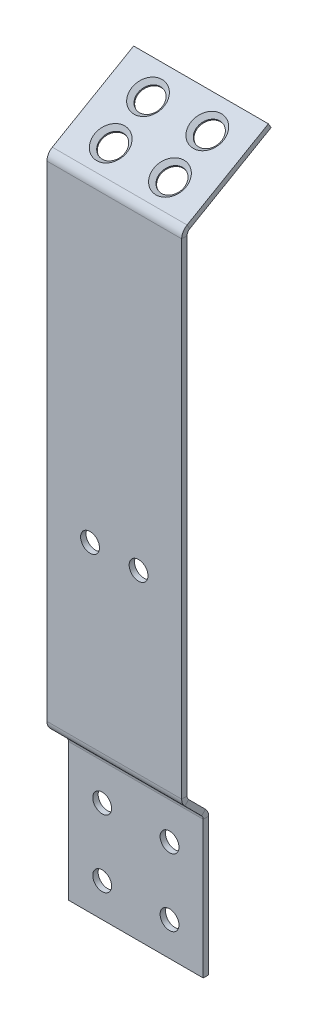
ISO-10303-21;
HEADER;
FILE_DESCRIPTION(('STEP AP214'),'2;1');
FILE_NAME('part.step','',(''),(''),'','','');
FILE_SCHEMA(('AUTOMOTIVE_DESIGN { 1 0 10303 214 1 1 1 1 }'));
ENDSEC;
DATA;
#1=APPLICATION_CONTEXT('core data for automotive mechanical design processes');
#2=APPLICATION_PROTOCOL_DEFINITION('international standard','automotive_design',2000,#1);
#3=PRODUCT_CONTEXT('',#1,'mechanical');
#4=PRODUCT('Part','Part','',(#3));
#5=PRODUCT_RELATED_PRODUCT_CATEGORY('part','',(#4));
#6=PRODUCT_DEFINITION_FORMATION('','',#4);
#7=PRODUCT_DEFINITION_CONTEXT('part definition',#1,'design');
#8=PRODUCT_DEFINITION('design','',#6,#7);
#9=PRODUCT_DEFINITION_SHAPE('','',#8);
#10=(LENGTH_UNIT() NAMED_UNIT(*) SI_UNIT(.MILLI.,.METRE.));
#11=(NAMED_UNIT(*) PLANE_ANGLE_UNIT() SI_UNIT($,.RADIAN.));
#12=(NAMED_UNIT(*) SI_UNIT($,.STERADIAN.) SOLID_ANGLE_UNIT());
#13=UNCERTAINTY_MEASURE_WITH_UNIT(LENGTH_MEASURE(1.E-05),#10,'distance_accuracy_value','');
#14=(GEOMETRIC_REPRESENTATION_CONTEXT(3) GLOBAL_UNCERTAINTY_ASSIGNED_CONTEXT((#13)) GLOBAL_UNIT_ASSIGNED_CONTEXT((#10,
#11,#12)) REPRESENTATION_CONTEXT('',''));
#15=CARTESIAN_POINT('',(0.,0.,0.));
#16=DIRECTION('',(0.,0.,1.));
#17=DIRECTION('',(1.,0.,0.));
#18=AXIS2_PLACEMENT_3D('',#15,#16,#17);
#19=CARTESIAN_POINT('',(-25.,242.195792681395,9.99999999999999));
#20=DIRECTION('',(0.,0.,-1.));
#21=DIRECTION('',(-1.,0.,0.));
#22=AXIS2_PLACEMENT_3D('',#19,#20,#21);
#23=PLANE('',#22);
#24=CARTESIAN_POINT('',(9.,127.,9.99999999999999));
#25=DIRECTION('',(0.,0.,1.));
#26=DIRECTION('',(1.,0.,0.));
#27=AXIS2_PLACEMENT_3D('',#24,#25,#26);
#28=CIRCLE('',#27,3.50000000000001);
#29=CARTESIAN_POINT('',(12.5,127.,9.99999999999999));
#30=VERTEX_POINT('',#29);
#31=EDGE_CURVE('E798',#30,#30,#28,.T.);
#32=ORIENTED_EDGE('',*,*,#31,.F.);
#33=EDGE_LOOP('',(#32));
#34=FACE_BOUND('',#33,.T.);
#35=CARTESIAN_POINT('',(-9.,127.,9.99999999999999));
#36=DIRECTION('',(0.,0.,1.));
#37=DIRECTION('',(1.,0.,0.));
#38=AXIS2_PLACEMENT_3D('',#35,#36,#37);
#39=CIRCLE('',#38,3.50000000000001);
#40=CARTESIAN_POINT('',(-5.49999999999999,127.,9.99999999999999));
#41=VERTEX_POINT('',#40);
#42=EDGE_CURVE('E791',#41,#41,#39,.T.);
#43=ORIENTED_EDGE('',*,*,#42,.F.);
#44=EDGE_LOOP('',(#43));
#45=FACE_BOUND('',#44,.T.);
#46=DIRECTION('',(0.,-1.,0.));
#47=VECTOR('',#46,1.);
#48=CARTESIAN_POINT('',(-25.,-2.80420731860514,10.));
#49=LINE('',#48,#47);
#50=CARTESIAN_POINT('',(-25.,241.535898384862,10.));
#51=VERTEX_POINT('',#50);
#52=CARTESIAN_POINT('',(-25.,61.4852813742385,10.0000000334032));
#53=VERTEX_POINT('',#52);
#54=EDGE_CURVE('E189',#51,#53,#49,.T.);
#55=ORIENTED_EDGE('',*,*,#54,.T.);
#56=DIRECTION('',(1.,0.,0.));
#57=VECTOR('',#56,1.);
#58=CARTESIAN_POINT('',(-25.,61.4852813742385,10.));
#59=LINE('',#58,#57);
#60=CARTESIAN_POINT('',(25.,61.4852813742385,10.));
#61=VERTEX_POINT('',#60);
#62=EDGE_CURVE('E177',#53,#61,#59,.T.);
#63=ORIENTED_EDGE('',*,*,#62,.T.);
#64=DIRECTION('',(0.,1.,0.));
#65=VECTOR('',#64,1.);
#66=CARTESIAN_POINT('',(25.,-2.80420731860514,10.));
#67=LINE('',#66,#65);
#68=CARTESIAN_POINT('',(25.,241.535898384862,10.));
#69=VERTEX_POINT('',#68);
#70=EDGE_CURVE('E181',#61,#69,#67,.T.);
#71=ORIENTED_EDGE('',*,*,#70,.T.);
#72=DIRECTION('',(1.,0.,0.));
#73=VECTOR('',#72,1.);
#74=CARTESIAN_POINT('',(25.,241.535898384862,10.));
#75=LINE('',#74,#73);
#76=EDGE_CURVE('E145',#69,#51,#75,.F.);
#77=ORIENTED_EDGE('',*,*,#76,.T.);
#78=EDGE_LOOP('',(#55,#63,#71,#77));
#79=FACE_BOUND('',#78,.T.);
#80=ADVANCED_FACE('F65',(#34,#45,#79),#23,.F.);
#81=CARTESIAN_POINT('',(25.,-2.80420731860514,10.));
#82=DIRECTION('',(-1.,0.,0.));
#83=DIRECTION('',(0.,0.,1.));
#84=AXIS2_PLACEMENT_3D('',#81,#82,#83);
#85=PLANE('',#84);
#86=ORIENTED_EDGE('',*,*,#70,.F.);
#87=DIRECTION('',(0.,0.,-1.));
#88=VECTOR('',#87,1.);
#89=CARTESIAN_POINT('',(25.,61.4852813742386,10.0000000000005));
#90=LINE('',#89,#88);
#91=CARTESIAN_POINT('',(25.,61.4852813742385,8.00000003340319));
#92=VERTEX_POINT('',#91);
#93=EDGE_CURVE('E13',#61,#92,#90,.T.);
#94=ORIENTED_EDGE('',*,*,#93,.T.);
#95=DIRECTION('',(0.,1.,0.));
#96=VECTOR('',#95,1.);
#97=CARTESIAN_POINT('',(25.,-2.80420731860514,8.00000000000001));
#98=LINE('',#97,#96);
#99=CARTESIAN_POINT('',(25.,241.535898384862,8.00000000000003));
#100=VERTEX_POINT('',#99);
#101=EDGE_CURVE('E186',#92,#100,#98,.T.);
#102=ORIENTED_EDGE('',*,*,#101,.T.);
#103=DIRECTION('',(0.,0.,1.));
#104=VECTOR('',#103,1.);
#105=CARTESIAN_POINT('',(25.,241.535898384862,8.00000000000003));
#106=LINE('',#105,#104);
#107=EDGE_CURVE('E240',#100,#69,#106,.T.);
#108=ORIENTED_EDGE('',*,*,#107,.T.);
#109=EDGE_LOOP('',(#86,#94,#102,#108));
#110=FACE_BOUND('',#109,.T.);
#111=ADVANCED_FACE('F67',(#110),#85,.F.);
#112=CARTESIAN_POINT('',(-25.,-2.80420731860514,10.));
#113=DIRECTION('',(1.,0.,0.));
#114=DIRECTION('',(0.,0.,-1.));
#115=AXIS2_PLACEMENT_3D('',#112,#113,#114);
#116=PLANE('',#115);
#117=DIRECTION('',(0.,-1.,0.));
#118=VECTOR('',#117,1.);
#119=CARTESIAN_POINT('',(-25.,-2.80420731860515,8.00000000000001));
#120=LINE('',#119,#118);
#121=CARTESIAN_POINT('',(-25.,241.535898384862,8.00000000000003));
#122=VERTEX_POINT('',#121);
#123=CARTESIAN_POINT('',(-24.9999999999999,61.4852813742385,8.00000003340319));
#124=VERTEX_POINT('',#123);
#125=EDGE_CURVE('E176',#122,#124,#120,.T.);
#126=ORIENTED_EDGE('',*,*,#125,.T.);
#127=DIRECTION('',(0.,0.,1.));
#128=VECTOR('',#127,1.);
#129=CARTESIAN_POINT('',(-25.,61.4852813742386,10.0000000000005));
#130=LINE('',#129,#128);
#131=EDGE_CURVE('E180',#124,#53,#130,.T.);
#132=ORIENTED_EDGE('',*,*,#131,.T.);
#133=ORIENTED_EDGE('',*,*,#54,.F.);
#134=DIRECTION('',(0.,0.,1.));
#135=VECTOR('',#134,1.);
#136=CARTESIAN_POINT('',(-25.,241.535898384862,8.00000000000003));
#137=LINE('',#136,#135);
#138=EDGE_CURVE('E322',#122,#51,#137,.T.);
#139=ORIENTED_EDGE('',*,*,#138,.F.);
#140=EDGE_LOOP('',(#126,#132,#133,#139));
#141=FACE_BOUND('',#140,.T.);
#142=ADVANCED_FACE('F366',(#141),#116,.F.);
#143=CARTESIAN_POINT('',(-25.,242.195792681395,7.99999999999999));
#144=DIRECTION('',(0.,0.,-1.));
#145=DIRECTION('',(-1.,0.,0.));
#146=AXIS2_PLACEMENT_3D('',#143,#144,#145);
#147=PLANE('',#146);
#148=CARTESIAN_POINT('',(9.,127.,7.99999999999999));
#149=DIRECTION('',(0.,0.,1.));
#150=DIRECTION('',(1.,0.,0.));
#151=AXIS2_PLACEMENT_3D('',#148,#149,#150);
#152=CIRCLE('',#151,3.50000000000001);
#153=CARTESIAN_POINT('',(12.5,127.,7.99999999999999));
#154=VERTEX_POINT('',#153);
#155=EDGE_CURVE('E383',#154,#154,#152,.T.);
#156=ORIENTED_EDGE('',*,*,#155,.T.);
#157=EDGE_LOOP('',(#156));
#158=FACE_BOUND('',#157,.T.);
#159=CARTESIAN_POINT('',(-9.,127.,7.99999999999999));
#160=DIRECTION('',(0.,0.,1.));
#161=DIRECTION('',(1.,0.,0.));
#162=AXIS2_PLACEMENT_3D('',#159,#160,#161);
#163=CIRCLE('',#162,3.50000000000001);
#164=CARTESIAN_POINT('',(-5.49999999999999,127.,7.99999999999999));
#165=VERTEX_POINT('',#164);
#166=EDGE_CURVE('E387',#165,#165,#163,.T.);
#167=ORIENTED_EDGE('',*,*,#166,.T.);
#168=EDGE_LOOP('',(#167));
#169=FACE_BOUND('',#168,.T.);
#170=DIRECTION('',(1.,0.,0.));
#171=VECTOR('',#170,1.);
#172=CARTESIAN_POINT('',(-25.,61.4852813742386,8.00000000000001));
#173=LINE('',#172,#171);
#174=EDGE_CURVE('E74',#124,#92,#173,.T.);
#175=ORIENTED_EDGE('',*,*,#174,.F.);
#176=ORIENTED_EDGE('',*,*,#125,.F.);
#177=DIRECTION('',(1.,0.,0.));
#178=VECTOR('',#177,1.);
#179=CARTESIAN_POINT('',(25.,241.535898384862,8.00000000000003));
#180=LINE('',#179,#178);
#181=EDGE_CURVE('E158',#100,#122,#180,.F.);
#182=ORIENTED_EDGE('',*,*,#181,.F.);
#183=ORIENTED_EDGE('',*,*,#101,.F.);
#184=EDGE_LOOP('',(#175,#176,#182,#183));
#185=FACE_BOUND('',#184,.T.);
#186=ADVANCED_FACE('F372',(#158,#169,#185),#147,.T.);
#187=CARTESIAN_POINT('',(-25.,241.535898384862,6.00000000000003));
#188=DIRECTION('',(-1.,0.,0.));
#189=DIRECTION('',(0.,0.,1.));
#190=AXIS2_PLACEMENT_3D('',#187,#188,#189);
#191=PLANE('',#190);
#192=DIRECTION('',(0.,-0.866025403784437,-0.500000000000004));
#193=VECTOR('',#192,1.);
#194=CARTESIAN_POINT('',(-25.,245.,8.00000000000004));
#195=LINE('',#194,#193);
#196=CARTESIAN_POINT('',(-25.,243.267949192431,7.00000000000003));
#197=VERTEX_POINT('',#196);
#198=CARTESIAN_POINT('',(-25.,245.,8.00000000000003));
#199=VERTEX_POINT('',#198);
#200=EDGE_CURVE('E174',#197,#199,#195,.F.);
#201=ORIENTED_EDGE('',*,*,#200,.F.);
#202=CARTESIAN_POINT('',(-25.,241.535898384862,6.00000000000003));
#203=DIRECTION('',(1.,0.,0.));
#204=DIRECTION('',(0.,0.,-1.));
#205=AXIS2_PLACEMENT_3D('',#202,#203,#204);
#206=CIRCLE('',#205,2.00000000000001);
#207=EDGE_CURVE('E328',#122,#197,#206,.F.);
#208=ORIENTED_EDGE('',*,*,#207,.F.);
#209=ORIENTED_EDGE('',*,*,#138,.T.);
#210=CARTESIAN_POINT('',(-25.,241.535898384862,6.00000000000003));
#211=DIRECTION('',(1.,0.,0.));
#212=DIRECTION('',(0.,0.,-1.));
#213=AXIS2_PLACEMENT_3D('',#210,#211,#212);
#214=CIRCLE('',#213,4.00000000000001);
#215=EDGE_CURVE('E152',#51,#199,#214,.F.);
#216=ORIENTED_EDGE('',*,*,#215,.T.);
#217=EDGE_LOOP('',(#201,#208,#209,#216));
#218=FACE_BOUND('',#217,.T.);
#219=ADVANCED_FACE('F340',(#218),#191,.T.);
#220=CARTESIAN_POINT('',(25.,241.535898384862,6.00000000000003));
#221=DIRECTION('',(-1.,0.,0.));
#222=DIRECTION('',(0.,0.,1.));
#223=AXIS2_PLACEMENT_3D('',#220,#221,#222);
#224=PLANE('',#223);
#225=CARTESIAN_POINT('',(25.,241.535898384862,6.00000000000003));
#226=DIRECTION('',(1.,0.,0.));
#227=DIRECTION('',(0.,0.,-1.));
#228=AXIS2_PLACEMENT_3D('',#225,#226,#227);
#229=CIRCLE('',#228,2.00000000000001);
#230=CARTESIAN_POINT('',(25.,243.267949192431,7.00000000000003));
#231=VERTEX_POINT('',#230);
#232=EDGE_CURVE('E151',#231,#100,#229,.T.);
#233=ORIENTED_EDGE('',*,*,#232,.F.);
#234=DIRECTION('',(0.,-0.866025403784437,-0.500000000000004));
#235=VECTOR('',#234,1.);
#236=CARTESIAN_POINT('',(25.,243.267949192431,7.00000000000007));
#237=LINE('',#236,#235);
#238=CARTESIAN_POINT('',(25.,245.,8.00000000000004));
#239=VERTEX_POINT('',#238);
#240=EDGE_CURVE('E148',#231,#239,#237,.F.);
#241=ORIENTED_EDGE('',*,*,#240,.T.);
#242=CARTESIAN_POINT('',(25.,241.535898384862,6.00000000000003));
#243=DIRECTION('',(1.,0.,0.));
#244=DIRECTION('',(0.,0.,-1.));
#245=AXIS2_PLACEMENT_3D('',#242,#243,#244);
#246=CIRCLE('',#245,4.00000000000001);
#247=EDGE_CURVE('E138',#239,#69,#246,.T.);
#248=ORIENTED_EDGE('',*,*,#247,.T.);
#249=ORIENTED_EDGE('',*,*,#107,.F.);
#250=EDGE_LOOP('',(#233,#241,#248,#249));
#251=FACE_BOUND('',#250,.T.);
#252=ADVANCED_FACE('F150',(#251),#224,.F.);
#253=CARTESIAN_POINT('',(25.,241.535898384862,6.00000000000003));
#254=DIRECTION('',(1.,0.,0.));
#255=DIRECTION('',(0.,0.866025403784437,0.500000000000004));
#256=AXIS2_PLACEMENT_3D('',#253,#254,#255);
#257=CYLINDRICAL_SURFACE('',#256,4.00000000000001);
#258=ORIENTED_EDGE('',*,*,#76,.F.);
#259=ORIENTED_EDGE('',*,*,#247,.F.);
#260=DIRECTION('',(1.,0.,0.));
#261=VECTOR('',#260,1.);
#262=CARTESIAN_POINT('',(-25.,245.,8.00000000000004));
#263=LINE('',#262,#261);
#264=EDGE_CURVE('E142',#239,#199,#263,.F.);
#265=ORIENTED_EDGE('',*,*,#264,.T.);
#266=ORIENTED_EDGE('',*,*,#215,.F.);
#267=EDGE_LOOP('',(#258,#259,#265,#266));
#268=FACE_BOUND('',#267,.T.);
#269=ADVANCED_FACE('F140',(#268),#257,.T.);
#270=CARTESIAN_POINT('',(25.,241.535898384862,6.00000000000003));
#271=DIRECTION('',(1.,0.,0.));
#272=DIRECTION('',(0.,0.866025403784437,0.500000000000004));
#273=AXIS2_PLACEMENT_3D('',#270,#271,#272);
#274=CYLINDRICAL_SURFACE('',#273,2.00000000000001);
#275=ORIENTED_EDGE('',*,*,#181,.T.);
#276=ORIENTED_EDGE('',*,*,#207,.T.);
#277=DIRECTION('',(1.,0.,0.));
#278=VECTOR('',#277,1.);
#279=CARTESIAN_POINT('',(-25.,243.267949192431,7.00000000000003));
#280=LINE('',#279,#278);
#281=EDGE_CURVE('E118',#197,#231,#280,.T.);
#282=ORIENTED_EDGE('',*,*,#281,.T.);
#283=ORIENTED_EDGE('',*,*,#232,.T.);
#284=EDGE_LOOP('',(#275,#276,#282,#283));
#285=FACE_BOUND('',#284,.T.);
#286=ADVANCED_FACE('F341',(#285),#274,.F.);
#287=CARTESIAN_POINT('',(25.,262.422649730811,-22.1769145362397));
#288=DIRECTION('',(-1.,0.,0.));
#289=DIRECTION('',(0.,0.,1.));
#290=AXIS2_PLACEMENT_3D('',#287,#288,#289);
#291=PLANE('',#290);
#292=ORIENTED_EDGE('',*,*,#240,.F.);
#293=DIRECTION('',(0.,-0.500000000000004,0.866025403784437));
#294=VECTOR('',#293,1.);
#295=CARTESIAN_POINT('',(25.,260.690598923242,-23.1769145362397));
#296=LINE('',#295,#294);
#297=CARTESIAN_POINT('',(25.,260.690598923242,-23.1769145362397));
#298=VERTEX_POINT('',#297);
#299=EDGE_CURVE('E110',#231,#298,#296,.F.);
#300=ORIENTED_EDGE('',*,*,#299,.T.);
#301=DIRECTION('',(0.,-0.866025403784436,-0.500000000000004));
#302=VECTOR('',#301,1.);
#303=CARTESIAN_POINT('',(25.,262.422649730811,-22.1769145362397));
#304=LINE('',#303,#302);
#305=CARTESIAN_POINT('',(25.,262.42264973081,-22.1769145362397));
#306=VERTEX_POINT('',#305);
#307=EDGE_CURVE('E161',#306,#298,#304,.T.);
#308=ORIENTED_EDGE('',*,*,#307,.F.);
#309=DIRECTION('',(0.,0.500000000000004,-0.866025403784437));
#310=VECTOR('',#309,1.);
#311=CARTESIAN_POINT('',(25.,244.42264973081,9.));
#312=LINE('',#311,#310);
#313=EDGE_CURVE('E103',#239,#306,#312,.T.);
#314=ORIENTED_EDGE('',*,*,#313,.F.);
#315=EDGE_LOOP('',(#292,#300,#308,#314));
#316=FACE_BOUND('',#315,.T.);
#317=ADVANCED_FACE('F160',(#316),#291,.F.);
#318=CARTESIAN_POINT('',(-25.,244.42264973081,9.));
#319=DIRECTION('',(1.,0.,0.));
#320=DIRECTION('',(0.,0.,-1.));
#321=AXIS2_PLACEMENT_3D('',#318,#319,#320);
#322=PLANE('',#321);
#323=ORIENTED_EDGE('',*,*,#200,.T.);
#324=DIRECTION('',(0.,-0.500000000000004,0.866025403784437));
#325=VECTOR('',#324,1.);
#326=CARTESIAN_POINT('',(-25.,244.42264973081,9.));
#327=LINE('',#326,#325);
#328=CARTESIAN_POINT('',(-25.,262.422649730811,-22.1769145362397));
#329=VERTEX_POINT('',#328);
#330=EDGE_CURVE('E157',#329,#199,#327,.T.);
#331=ORIENTED_EDGE('',*,*,#330,.F.);
#332=DIRECTION('',(0.,-0.866025403784436,-0.500000000000004));
#333=VECTOR('',#332,1.);
#334=CARTESIAN_POINT('',(-25.,262.422649730811,-22.1769145362397));
#335=LINE('',#334,#333);
#336=CARTESIAN_POINT('',(-25.,260.690598923242,-23.1769145362397));
#337=VERTEX_POINT('',#336);
#338=EDGE_CURVE('E168',#329,#337,#335,.T.);
#339=ORIENTED_EDGE('',*,*,#338,.T.);
#340=DIRECTION('',(0.,0.500000000000004,-0.866025403784437));
#341=VECTOR('',#340,1.);
#342=CARTESIAN_POINT('',(-25.,242.690598923242,8.));
#343=LINE('',#342,#341);
#344=EDGE_CURVE('E164',#337,#197,#343,.F.);
#345=ORIENTED_EDGE('',*,*,#344,.T.);
#346=EDGE_LOOP('',(#323,#331,#339,#345));
#347=FACE_BOUND('',#346,.T.);
#348=ADVANCED_FACE('F336',(#347),#322,.F.);
#349=CARTESIAN_POINT('',(-25.,244.42264973081,9.));
#350=DIRECTION('',(0.,-0.866025403784437,-0.500000000000004));
#351=DIRECTION('',(0.,0.500000000000004,-0.866025403784437));
#352=AXIS2_PLACEMENT_3D('',#349,#350,#351);
#353=PLANE('',#352);
#354=CARTESIAN_POINT('',(-11.,257.422649730811,-13.5166604983953));
#355=DIRECTION('',(0.,0.866025403784436,0.500000000000004));
#356=DIRECTION('',(0.,-0.500000000000004,0.866025403784437));
#357=AXIS2_PLACEMENT_3D('',#354,#355,#356);
#358=CIRCLE('',#357,6.);
#359=CARTESIAN_POINT('',(-11.,254.422649730811,-8.32050807568868));
#360=VERTEX_POINT('',#359);
#361=EDGE_CURVE('E615',#360,#360,#358,.T.);
#362=ORIENTED_EDGE('',*,*,#361,.F.);
#363=EDGE_LOOP('',(#362));
#364=FACE_BOUND('',#363,.T.);
#365=CARTESIAN_POINT('',(11.,257.422649730811,-13.5166604983953));
#366=DIRECTION('',(0.,0.866025403784436,0.500000000000004));
#367=DIRECTION('',(0.,-0.500000000000004,0.866025403784437));
#368=AXIS2_PLACEMENT_3D('',#365,#366,#367);
#369=CIRCLE('',#368,6.);
#370=CARTESIAN_POINT('',(11.,254.422649730811,-8.32050807568868));
#371=VERTEX_POINT('',#370);
#372=EDGE_CURVE('E213',#371,#371,#369,.T.);
#373=ORIENTED_EDGE('',*,*,#372,.F.);
#374=EDGE_LOOP('',(#373));
#375=FACE_BOUND('',#374,.T.);
#376=CARTESIAN_POINT('',(11.,249.422649730811,0.339745962155677));
#377=DIRECTION('',(0.,0.866025403784436,0.500000000000004));
#378=DIRECTION('',(0.,-0.500000000000004,0.866025403784437));
#379=AXIS2_PLACEMENT_3D('',#376,#377,#378);
#380=CIRCLE('',#379,6.);
#381=CARTESIAN_POINT('',(11.,246.42264973081,5.5358983848623));
#382=VERTEX_POINT('',#381);
#383=EDGE_CURVE('E206',#382,#382,#380,.T.);
#384=ORIENTED_EDGE('',*,*,#383,.F.);
#385=EDGE_LOOP('',(#384));
#386=FACE_BOUND('',#385,.T.);
#387=CARTESIAN_POINT('',(-11.,249.422649730811,0.339745962155677));
#388=DIRECTION('',(0.,0.866025403784436,0.500000000000004));
#389=DIRECTION('',(0.,-0.500000000000004,0.866025403784437));
#390=AXIS2_PLACEMENT_3D('',#387,#388,#389);
#391=CIRCLE('',#390,6.);
#392=CARTESIAN_POINT('',(-11.,246.42264973081,5.5358983848623));
#393=VERTEX_POINT('',#392);
#394=EDGE_CURVE('E202',#393,#393,#391,.T.);
#395=ORIENTED_EDGE('',*,*,#394,.F.);
#396=EDGE_LOOP('',(#395));
#397=FACE_BOUND('',#396,.T.);
#398=ORIENTED_EDGE('',*,*,#264,.F.);
#399=ORIENTED_EDGE('',*,*,#313,.T.);
#400=DIRECTION('',(-1.,0.,0.));
#401=VECTOR('',#400,1.);
#402=CARTESIAN_POINT('',(-25.,262.42264973081,-22.1769145362397));
#403=LINE('',#402,#401);
#404=EDGE_CURVE('E163',#306,#329,#403,.T.);
#405=ORIENTED_EDGE('',*,*,#404,.T.);
#406=ORIENTED_EDGE('',*,*,#330,.T.);
#407=EDGE_LOOP('',(#398,#399,#405,#406));
#408=FACE_BOUND('',#407,.T.);
#409=ADVANCED_FACE('F155',(#364,#375,#386,#397,#408),#353,.F.);
#410=CARTESIAN_POINT('',(-25.,242.690598923242,8.));
#411=DIRECTION('',(0.,-0.866025403784437,-0.500000000000004));
#412=DIRECTION('',(0.,0.500000000000004,-0.866025403784437));
#413=AXIS2_PLACEMENT_3D('',#410,#411,#412);
#414=PLANE('',#413);
#415=CARTESIAN_POINT('',(-11.,255.690598923242,-14.5166604983954));
#416=DIRECTION('',(0.,-0.866025403784437,-0.500000000000004));
#417=DIRECTION('',(0.,0.500000000000004,-0.866025403784436));
#418=AXIS2_PLACEMENT_3D('',#415,#416,#417);
#419=CIRCLE('',#418,4.49999999999999);
#420=CARTESIAN_POINT('',(-11.,257.940598923242,-18.4137748154253));
#421=VERTEX_POINT('',#420);
#422=EDGE_CURVE('E69',#421,#421,#419,.T.);
#423=ORIENTED_EDGE('',*,*,#422,.F.);
#424=EDGE_LOOP('',(#423));
#425=FACE_BOUND('',#424,.T.);
#426=CARTESIAN_POINT('',(11.,255.690598923242,-14.5166604983954));
#427=DIRECTION('',(0.,-0.866025403784437,-0.500000000000004));
#428=DIRECTION('',(0.,0.500000000000004,-0.866025403784436));
#429=AXIS2_PLACEMENT_3D('',#426,#427,#428);
#430=CIRCLE('',#429,4.49999999999999);
#431=CARTESIAN_POINT('',(11.,257.940598923242,-18.4137748154253));
#432=VERTEX_POINT('',#431);
#433=EDGE_CURVE('E204',#432,#432,#430,.T.);
#434=ORIENTED_EDGE('',*,*,#433,.F.);
#435=EDGE_LOOP('',(#434));
#436=FACE_BOUND('',#435,.T.);
#437=CARTESIAN_POINT('',(11.,247.690598923242,-0.660254037844378));
#438=DIRECTION('',(0.,-0.866025403784437,-0.500000000000004));
#439=DIRECTION('',(0.,0.500000000000004,-0.866025403784436));
#440=AXIS2_PLACEMENT_3D('',#437,#438,#439);
#441=CIRCLE('',#440,4.49999999999999);
#442=CARTESIAN_POINT('',(11.,249.940598923242,-4.55736835487433));
#443=VERTEX_POINT('',#442);
#444=EDGE_CURVE('E200',#443,#443,#441,.T.);
#445=ORIENTED_EDGE('',*,*,#444,.F.);
#446=EDGE_LOOP('',(#445));
#447=FACE_BOUND('',#446,.T.);
#448=CARTESIAN_POINT('',(-11.,247.690598923242,-0.660254037844378));
#449=DIRECTION('',(0.,-0.866025403784437,-0.500000000000004));
#450=DIRECTION('',(0.,0.500000000000004,-0.866025403784436));
#451=AXIS2_PLACEMENT_3D('',#448,#449,#450);
#452=CIRCLE('',#451,4.49999999999999);
#453=CARTESIAN_POINT('',(-11.,249.940598923242,-4.55736835487433));
#454=VERTEX_POINT('',#453);
#455=EDGE_CURVE('E195',#454,#454,#452,.T.);
#456=ORIENTED_EDGE('',*,*,#455,.F.);
#457=EDGE_LOOP('',(#456));
#458=FACE_BOUND('',#457,.T.);
#459=ORIENTED_EDGE('',*,*,#299,.F.);
#460=ORIENTED_EDGE('',*,*,#281,.F.);
#461=ORIENTED_EDGE('',*,*,#344,.F.);
#462=DIRECTION('',(1.,0.,0.));
#463=VECTOR('',#462,1.);
#464=CARTESIAN_POINT('',(-25.,260.690598923242,-23.1769145362397));
#465=LINE('',#464,#463);
#466=EDGE_CURVE('E91',#298,#337,#465,.F.);
#467=ORIENTED_EDGE('',*,*,#466,.F.);
#468=EDGE_LOOP('',(#459,#460,#461,#467));
#469=FACE_BOUND('',#468,.T.);
#470=ADVANCED_FACE('F344',(#425,#436,#447,#458,#469),#414,.T.);
#471=CARTESIAN_POINT('',(-25.,262.422649730811,-22.1769145362397));
#472=DIRECTION('',(0.,-0.500000000000004,0.866025403784436));
#473=DIRECTION('',(0.,-0.866025403784436,-0.500000000000004));
#474=AXIS2_PLACEMENT_3D('',#471,#472,#473);
#475=PLANE('',#474);
#476=ORIENTED_EDGE('',*,*,#466,.T.);
#477=ORIENTED_EDGE('',*,*,#338,.F.);
#478=ORIENTED_EDGE('',*,*,#404,.F.);
#479=ORIENTED_EDGE('',*,*,#307,.T.);
#480=EDGE_LOOP('',(#476,#477,#478,#479));
#481=FACE_BOUND('',#480,.T.);
#482=ADVANCED_FACE('F346',(#481),#475,.F.);
#483=CARTESIAN_POINT('',(-25.,0.,2.));
#484=DIRECTION('',(0.,1.,0.));
#485=DIRECTION('',(0.,0.,1.));
#486=AXIS2_PLACEMENT_3D('',#483,#484,#485);
#487=PLANE('',#486);
#488=DIRECTION('',(1.,0.,0.));
#489=VECTOR('',#488,1.);
#490=CARTESIAN_POINT('',(-25.,0.,0.));
#491=LINE('',#490,#489);
#492=CARTESIAN_POINT('',(-25.,0.,0.));
#493=VERTEX_POINT('',#492);
#494=CARTESIAN_POINT('',(25.,0.,0.));
#495=VERTEX_POINT('',#494);
#496=EDGE_CURVE('E310',#493,#495,#491,.T.);
#497=ORIENTED_EDGE('',*,*,#496,.T.);
#498=DIRECTION('',(0.,0.,-1.));
#499=VECTOR('',#498,1.);
#500=CARTESIAN_POINT('',(25.,0.,2.));
#501=LINE('',#500,#499);
#502=CARTESIAN_POINT('',(25.,0.,2.));
#503=VERTEX_POINT('',#502);
#504=EDGE_CURVE('E304',#503,#495,#501,.T.);
#505=ORIENTED_EDGE('',*,*,#504,.F.);
#506=DIRECTION('',(1.,0.,0.));
#507=VECTOR('',#506,1.);
#508=CARTESIAN_POINT('',(-25.,0.,2.));
#509=LINE('',#508,#507);
#510=CARTESIAN_POINT('',(-25.,0.,2.));
#511=VERTEX_POINT('',#510);
#512=EDGE_CURVE('E289',#511,#503,#509,.T.);
#513=ORIENTED_EDGE('',*,*,#512,.F.);
#514=DIRECTION('',(0.,0.,-1.));
#515=VECTOR('',#514,1.);
#516=CARTESIAN_POINT('',(-25.,0.,2.));
#517=LINE('',#516,#515);
#518=EDGE_CURVE('E307',#511,#493,#517,.T.);
#519=ORIENTED_EDGE('',*,*,#518,.T.);
#520=EDGE_LOOP('',(#497,#505,#513,#519));
#521=FACE_BOUND('',#520,.T.);
#522=ADVANCED_FACE('F353',(#521),#487,.F.);
#523=CARTESIAN_POINT('',(25.,0.,2.));
#524=DIRECTION('',(-1.,0.,0.));
#525=DIRECTION('',(0.,0.,1.));
#526=AXIS2_PLACEMENT_3D('',#523,#524,#525);
#527=PLANE('',#526);
#528=DIRECTION('',(0.,0.,-1.));
#529=VECTOR('',#528,1.);
#530=CARTESIAN_POINT('',(25.,51.,2.00000000000036));
#531=LINE('',#530,#529);
#532=CARTESIAN_POINT('',(25.,51.,2.));
#533=VERTEX_POINT('',#532);
#534=CARTESIAN_POINT('',(25.,51.,0.));
#535=VERTEX_POINT('',#534);
#536=EDGE_CURVE('E280',#533,#535,#531,.T.);
#537=ORIENTED_EDGE('',*,*,#536,.F.);
#538=DIRECTION('',(0.,1.,0.));
#539=VECTOR('',#538,1.);
#540=CARTESIAN_POINT('',(25.,0.,2.));
#541=LINE('',#540,#539);
#542=EDGE_CURVE('E286',#503,#533,#541,.T.);
#543=ORIENTED_EDGE('',*,*,#542,.F.);
#544=ORIENTED_EDGE('',*,*,#504,.T.);
#545=DIRECTION('',(0.,1.,0.));
#546=VECTOR('',#545,1.);
#547=CARTESIAN_POINT('',(25.,0.,0.));
#548=LINE('',#547,#546);
#549=EDGE_CURVE('E301',#495,#535,#548,.T.);
#550=ORIENTED_EDGE('',*,*,#549,.T.);
#551=EDGE_LOOP('',(#537,#543,#544,#550));
#552=FACE_BOUND('',#551,.T.);
#553=ADVANCED_FACE('F457',(#552),#527,.F.);
#554=CARTESIAN_POINT('',(-25.,245.,0.));
#555=DIRECTION('',(0.,0.,-1.));
#556=DIRECTION('',(-1.,0.,0.));
#557=AXIS2_PLACEMENT_3D('',#554,#555,#556);
#558=PLANE('',#557);
#559=CARTESIAN_POINT('',(12.5,37.5,0.));
#560=DIRECTION('',(0.,0.,1.));
#561=DIRECTION('',(1.,0.,0.));
#562=AXIS2_PLACEMENT_3D('',#559,#560,#561);
#563=CIRCLE('',#562,3.5);
#564=CARTESIAN_POINT('',(16.,37.5,0.));
#565=VERTEX_POINT('',#564);
#566=EDGE_CURVE('E582',#565,#565,#563,.T.);
#567=ORIENTED_EDGE('',*,*,#566,.T.);
#568=EDGE_LOOP('',(#567));
#569=FACE_BOUND('',#568,.T.);
#570=CARTESIAN_POINT('',(12.5,12.5,0.));
#571=DIRECTION('',(0.,0.,1.));
#572=DIRECTION('',(1.,0.,0.));
#573=AXIS2_PLACEMENT_3D('',#570,#571,#572);
#574=CIRCLE('',#573,3.5);
#575=CARTESIAN_POINT('',(16.,12.5,0.));
#576=VERTEX_POINT('',#575);
#577=EDGE_CURVE('E560',#576,#576,#574,.T.);
#578=ORIENTED_EDGE('',*,*,#577,.T.);
#579=EDGE_LOOP('',(#578));
#580=FACE_BOUND('',#579,.T.);
#581=CARTESIAN_POINT('',(-12.5,12.5,0.));
#582=DIRECTION('',(0.,0.,1.));
#583=DIRECTION('',(1.,0.,0.));
#584=AXIS2_PLACEMENT_3D('',#581,#582,#583);
#585=CIRCLE('',#584,3.5);
#586=CARTESIAN_POINT('',(-9.,12.5,0.));
#587=VERTEX_POINT('',#586);
#588=EDGE_CURVE('E806',#587,#587,#585,.T.);
#589=ORIENTED_EDGE('',*,*,#588,.T.);
#590=EDGE_LOOP('',(#589));
#591=FACE_BOUND('',#590,.T.);
#592=CARTESIAN_POINT('',(-12.5,37.5,0.));
#593=DIRECTION('',(0.,0.,1.));
#594=DIRECTION('',(1.,0.,0.));
#595=AXIS2_PLACEMENT_3D('',#592,#593,#594);
#596=CIRCLE('',#595,3.5);
#597=CARTESIAN_POINT('',(-8.99999999999999,37.5,0.));
#598=VERTEX_POINT('',#597);
#599=EDGE_CURVE('E611',#598,#598,#596,.T.);
#600=ORIENTED_EDGE('',*,*,#599,.T.);
#601=EDGE_LOOP('',(#600));
#602=FACE_BOUND('',#601,.T.);
#603=DIRECTION('',(0.,-1.,0.));
#604=VECTOR('',#603,1.);
#605=CARTESIAN_POINT('',(-25.,0.,0.));
#606=LINE('',#605,#604);
#607=CARTESIAN_POINT('',(-25.,51.,0.));
#608=VERTEX_POINT('',#607);
#609=EDGE_CURVE('E295',#608,#493,#606,.T.);
#610=ORIENTED_EDGE('',*,*,#609,.F.);
#611=DIRECTION('',(1.,0.,0.));
#612=VECTOR('',#611,1.);
#613=CARTESIAN_POINT('',(-25.,51.,0.));
#614=LINE('',#613,#612);
#615=EDGE_CURVE('E298',#608,#535,#614,.T.);
#616=ORIENTED_EDGE('',*,*,#615,.T.);
#617=ORIENTED_EDGE('',*,*,#549,.F.);
#618=ORIENTED_EDGE('',*,*,#496,.F.);
#619=EDGE_LOOP('',(#610,#616,#617,#618));
#620=FACE_BOUND('',#619,.T.);
#621=ADVANCED_FACE('F484',(#569,#580,#591,#602,#620),#558,.T.);
#622=CARTESIAN_POINT('',(-25.,0.,2.));
#623=DIRECTION('',(1.,0.,0.));
#624=DIRECTION('',(0.,0.,-1.));
#625=AXIS2_PLACEMENT_3D('',#622,#623,#624);
#626=PLANE('',#625);
#627=DIRECTION('',(0.,0.,1.));
#628=VECTOR('',#627,1.);
#629=CARTESIAN_POINT('',(-25.,51.,2.00000000000036));
#630=LINE('',#629,#628);
#631=CARTESIAN_POINT('',(-25.,51.,1.99999996952845));
#632=VERTEX_POINT('',#631);
#633=EDGE_CURVE('E271',#608,#632,#630,.T.);
#634=ORIENTED_EDGE('',*,*,#633,.F.);
#635=ORIENTED_EDGE('',*,*,#609,.T.);
#636=ORIENTED_EDGE('',*,*,#518,.F.);
#637=DIRECTION('',(0.,-1.,0.));
#638=VECTOR('',#637,1.);
#639=CARTESIAN_POINT('',(-25.,0.,2.));
#640=LINE('',#639,#638);
#641=EDGE_CURVE('E292',#632,#511,#640,.T.);
#642=ORIENTED_EDGE('',*,*,#641,.F.);
#643=EDGE_LOOP('',(#634,#635,#636,#642));
#644=FACE_BOUND('',#643,.T.);
#645=ADVANCED_FACE('F478',(#644),#626,.F.);
#646=CARTESIAN_POINT('',(-25.,245.,2.));
#647=DIRECTION('',(0.,0.,-1.));
#648=DIRECTION('',(-1.,0.,0.));
#649=AXIS2_PLACEMENT_3D('',#646,#647,#648);
#650=PLANE('',#649);
#651=CARTESIAN_POINT('',(12.5,37.5,2.));
#652=DIRECTION('',(0.,0.,1.));
#653=DIRECTION('',(1.,0.,0.));
#654=AXIS2_PLACEMENT_3D('',#651,#652,#653);
#655=CIRCLE('',#654,3.5);
#656=CARTESIAN_POINT('',(16.,37.5,2.));
#657=VERTEX_POINT('',#656);
#658=EDGE_CURVE('E586',#657,#657,#655,.T.);
#659=ORIENTED_EDGE('',*,*,#658,.F.);
#660=EDGE_LOOP('',(#659));
#661=FACE_BOUND('',#660,.T.);
#662=CARTESIAN_POINT('',(12.5,12.5,2.));
#663=DIRECTION('',(0.,0.,1.));
#664=DIRECTION('',(1.,0.,0.));
#665=AXIS2_PLACEMENT_3D('',#662,#663,#664);
#666=CIRCLE('',#665,3.5);
#667=CARTESIAN_POINT('',(16.,12.5,2.));
#668=VERTEX_POINT('',#667);
#669=EDGE_CURVE('E565',#668,#668,#666,.T.);
#670=ORIENTED_EDGE('',*,*,#669,.F.);
#671=EDGE_LOOP('',(#670));
#672=FACE_BOUND('',#671,.T.);
#673=CARTESIAN_POINT('',(-12.5,12.5,2.));
#674=DIRECTION('',(0.,0.,1.));
#675=DIRECTION('',(1.,0.,0.));
#676=AXIS2_PLACEMENT_3D('',#673,#674,#675);
#677=CIRCLE('',#676,3.5);
#678=CARTESIAN_POINT('',(-9.,12.5,2.));
#679=VERTEX_POINT('',#678);
#680=EDGE_CURVE('E564',#679,#679,#677,.T.);
#681=ORIENTED_EDGE('',*,*,#680,.F.);
#682=EDGE_LOOP('',(#681));
#683=FACE_BOUND('',#682,.T.);
#684=CARTESIAN_POINT('',(-12.5,37.5,2.));
#685=DIRECTION('',(0.,0.,1.));
#686=DIRECTION('',(1.,0.,0.));
#687=AXIS2_PLACEMENT_3D('',#684,#685,#686);
#688=CIRCLE('',#687,3.5);
#689=CARTESIAN_POINT('',(-8.99999999999999,37.5,2.));
#690=VERTEX_POINT('',#689);
#691=EDGE_CURVE('E616',#690,#690,#688,.T.);
#692=ORIENTED_EDGE('',*,*,#691,.F.);
#693=EDGE_LOOP('',(#692));
#694=FACE_BOUND('',#693,.T.);
#695=DIRECTION('',(1.,0.,0.));
#696=VECTOR('',#695,1.);
#697=CARTESIAN_POINT('',(-25.,51.,2.));
#698=LINE('',#697,#696);
#699=EDGE_CURVE('E268',#632,#533,#698,.T.);
#700=ORIENTED_EDGE('',*,*,#699,.F.);
#701=ORIENTED_EDGE('',*,*,#641,.T.);
#702=ORIENTED_EDGE('',*,*,#512,.T.);
#703=ORIENTED_EDGE('',*,*,#542,.T.);
#704=EDGE_LOOP('',(#700,#701,#702,#703));
#705=FACE_BOUND('',#704,.T.);
#706=ADVANCED_FACE('F468',(#661,#672,#683,#694,#705),#650,.F.);
#707=CARTESIAN_POINT('',(25.,51.,4.00000003569965));
#708=DIRECTION('',(-1.,0.,0.));
#709=DIRECTION('',(0.,0.,1.));
#710=AXIS2_PLACEMENT_3D('',#707,#708,#709);
#711=PLANE('',#710);
#712=CARTESIAN_POINT('',(25.,51.,4.));
#713=DIRECTION('',(-1.,0.,0.));
#714=DIRECTION('',(0.,-1.,0.));
#715=AXIS2_PLACEMENT_3D('',#712,#713,#714);
#716=CIRCLE('',#715,4.00000003569965);
#717=CARTESIAN_POINT('',(25.,53.8284271499896,1.17157285001035));
#718=VERTEX_POINT('',#717);
#719=EDGE_CURVE('E283',#535,#718,#716,.F.);
#720=ORIENTED_EDGE('',*,*,#719,.T.);
#721=DIRECTION('',(0.,0.707106781186554,-0.707106781186541));
#722=VECTOR('',#721,1.);
#723=CARTESIAN_POINT('',(25.,52.4142135623728,2.58578643762718));
#724=LINE('',#723,#722);
#725=CARTESIAN_POINT('',(25.,52.4142135623731,2.58578643762691));
#726=VERTEX_POINT('',#725);
#727=EDGE_CURVE('E241',#726,#718,#724,.T.);
#728=ORIENTED_EDGE('',*,*,#727,.F.);
#729=CARTESIAN_POINT('',(25.,51.,4.00000003569965));
#730=DIRECTION('',(1.,0.,0.));
#731=DIRECTION('',(0.,0.,-1.));
#732=AXIS2_PLACEMENT_3D('',#729,#730,#731);
#733=CIRCLE('',#732,2.0000000661712);
#734=EDGE_CURVE('E265',#533,#726,#733,.T.);
#735=ORIENTED_EDGE('',*,*,#734,.F.);
#736=ORIENTED_EDGE('',*,*,#536,.T.);
#737=EDGE_LOOP('',(#720,#728,#735,#736));
#738=FACE_BOUND('',#737,.T.);
#739=ADVANCED_FACE('F450',(#738),#711,.F.);
#740=CARTESIAN_POINT('',(50.0896722646355,51.,4.));
#741=DIRECTION('',(-1.,0.,0.));
#742=DIRECTION('',(0.,-1.,0.));
#743=AXIS2_PLACEMENT_3D('',#740,#741,#742);
#744=CYLINDRICAL_SURFACE('',#743,4.00000003569965);
#745=ORIENTED_EDGE('',*,*,#615,.F.);
#746=CARTESIAN_POINT('',(-25.,51.,4.));
#747=DIRECTION('',(-1.,0.,0.));
#748=DIRECTION('',(0.,-1.,0.));
#749=AXIS2_PLACEMENT_3D('',#746,#747,#748);
#750=CIRCLE('',#749,4.00000003569965);
#751=CARTESIAN_POINT('',(-25.,53.8284271499896,1.17157285001035));
#752=VERTEX_POINT('',#751);
#753=EDGE_CURVE('E274',#752,#608,#750,.T.);
#754=ORIENTED_EDGE('',*,*,#753,.F.);
#755=DIRECTION('',(1.,0.,0.));
#756=VECTOR('',#755,1.);
#757=CARTESIAN_POINT('',(-25.,53.8284271247462,1.17157287525384));
#758=LINE('',#757,#756);
#759=EDGE_CURVE('E277',#752,#718,#758,.T.);
#760=ORIENTED_EDGE('',*,*,#759,.T.);
#761=ORIENTED_EDGE('',*,*,#719,.F.);
#762=EDGE_LOOP('',(#745,#754,#760,#761));
#763=FACE_BOUND('',#762,.T.);
#764=ADVANCED_FACE('F444',(#763),#744,.T.);
#765=CARTESIAN_POINT('',(-25.,51.,4.00000003569965));
#766=DIRECTION('',(1.,0.,0.));
#767=DIRECTION('',(0.,0.,-1.));
#768=AXIS2_PLACEMENT_3D('',#765,#766,#767);
#769=PLANE('',#768);
#770=DIRECTION('',(0.,-0.707106781186554,0.707106781186541));
#771=VECTOR('',#770,1.);
#772=CARTESIAN_POINT('',(-25.,52.4142135623728,2.58578643762718));
#773=LINE('',#772,#771);
#774=CARTESIAN_POINT('',(-25.,52.4142135876165,2.58578641238345));
#775=VERTEX_POINT('',#774);
#776=EDGE_CURVE('E247',#752,#775,#773,.T.);
#777=ORIENTED_EDGE('',*,*,#776,.F.);
#778=ORIENTED_EDGE('',*,*,#753,.T.);
#779=ORIENTED_EDGE('',*,*,#633,.T.);
#780=CARTESIAN_POINT('',(-25.,51.,4.00000003569965));
#781=DIRECTION('',(-1.,0.,0.));
#782=DIRECTION('',(0.,0.,1.));
#783=AXIS2_PLACEMENT_3D('',#780,#781,#782);
#784=CIRCLE('',#783,2.0000000661712);
#785=EDGE_CURVE('E262',#775,#632,#784,.T.);
#786=ORIENTED_EDGE('',*,*,#785,.F.);
#787=EDGE_LOOP('',(#777,#778,#779,#786));
#788=FACE_BOUND('',#787,.T.);
#789=ADVANCED_FACE('F476',(#788),#769,.F.);
#790=CARTESIAN_POINT('',(50.0896722646355,51.,4.));
#791=DIRECTION('',(-1.,0.,0.));
#792=DIRECTION('',(0.,-1.,0.));
#793=AXIS2_PLACEMENT_3D('',#790,#791,#792);
#794=CYLINDRICAL_SURFACE('',#793,2.00000003569965);
#795=ORIENTED_EDGE('',*,*,#699,.T.);
#796=ORIENTED_EDGE('',*,*,#734,.T.);
#797=DIRECTION('',(1.,0.,0.));
#798=VECTOR('',#797,1.);
#799=CARTESIAN_POINT('',(-25.,52.4142135623731,2.58578643762691));
#800=LINE('',#799,#798);
#801=EDGE_CURVE('E256',#775,#726,#800,.T.);
#802=ORIENTED_EDGE('',*,*,#801,.F.);
#803=ORIENTED_EDGE('',*,*,#785,.T.);
#804=EDGE_LOOP('',(#795,#796,#802,#803));
#805=FACE_BOUND('',#804,.T.);
#806=ADVANCED_FACE('F463',(#805),#794,.F.);
#807=CARTESIAN_POINT('',(-25.,188.015705669517,138.187278544771));
#808=DIRECTION('',(0.,0.707106781186549,-0.707106781186546));
#809=DIRECTION('',(-1.,0.,0.));
#810=AXIS2_PLACEMENT_3D('',#807,#808,#809);
#811=PLANE('',#810);
#812=DIRECTION('',(1.,0.,0.));
#813=VECTOR('',#812,1.);
#814=CARTESIAN_POINT('',(-25.,58.6568542494924,8.8284271247462));
#815=LINE('',#814,#813);
#816=CARTESIAN_POINT('',(-25.,58.6568542293318,8.82842714490681));
#817=VERTEX_POINT('',#816);
#818=CARTESIAN_POINT('',(25.,58.6568542494924,8.82842712474621));
#819=VERTEX_POINT('',#818);
#820=EDGE_CURVE('E232',#817,#819,#815,.T.);
#821=ORIENTED_EDGE('',*,*,#820,.F.);
#822=DIRECTION('',(0.,-0.707106781186546,-0.707106781186549));
#823=VECTOR('',#822,1.);
#824=CARTESIAN_POINT('',(-25.,14.774544278813,-35.0538828459333));
#825=LINE('',#824,#823);
#826=EDGE_CURVE('E259',#817,#775,#825,.T.);
#827=ORIENTED_EDGE('',*,*,#826,.T.);
#828=ORIENTED_EDGE('',*,*,#801,.T.);
#829=DIRECTION('',(0.,0.707106781186546,0.707106781186549));
#830=VECTOR('',#829,1.);
#831=CARTESIAN_POINT('',(25.,14.774544278813,-35.0538828459333));
#832=LINE('',#831,#830);
#833=EDGE_CURVE('E253',#726,#819,#832,.T.);
#834=ORIENTED_EDGE('',*,*,#833,.T.);
#835=EDGE_LOOP('',(#821,#827,#828,#834));
#836=FACE_BOUND('',#835,.T.);
#837=ADVANCED_FACE('F421',(#836),#811,.F.);
#838=CARTESIAN_POINT('',(-25.,14.774544278813,-35.0538828459333));
#839=DIRECTION('',(1.,0.,0.));
#840=DIRECTION('',(0.,0.707106781186549,-0.707106781186546));
#841=AXIS2_PLACEMENT_3D('',#838,#839,#840);
#842=PLANE('',#841);
#843=DIRECTION('',(0.,-0.707106781186554,0.707106781186541));
#844=VECTOR('',#843,1.);
#845=CARTESIAN_POINT('',(-25.,58.6568542494921,8.82842712474652));
#846=LINE('',#845,#844);
#847=CARTESIAN_POINT('',(-25.,60.0710678118655,7.41421356237313));
#848=VERTEX_POINT('',#847);
#849=EDGE_CURVE('E313',#848,#817,#846,.T.);
#850=ORIENTED_EDGE('',*,*,#849,.F.);
#851=DIRECTION('',(0.,-0.707106781186546,-0.707106781186549));
#852=VECTOR('',#851,1.);
#853=CARTESIAN_POINT('',(-25.,16.1887578411861,-36.4680964083064));
#854=LINE('',#853,#852);
#855=EDGE_CURVE('E250',#848,#752,#854,.T.);
#856=ORIENTED_EDGE('',*,*,#855,.T.);
#857=ORIENTED_EDGE('',*,*,#776,.T.);
#858=ORIENTED_EDGE('',*,*,#826,.F.);
#859=EDGE_LOOP('',(#850,#856,#857,#858));
#860=FACE_BOUND('',#859,.T.);
#861=ADVANCED_FACE('F429',(#860),#842,.F.);
#862=CARTESIAN_POINT('',(-25.,189.42991923189,136.773064982398));
#863=DIRECTION('',(0.,0.707106781186549,-0.707106781186546));
#864=DIRECTION('',(-1.,0.,0.));
#865=AXIS2_PLACEMENT_3D('',#862,#863,#864);
#866=PLANE('',#865);
#867=ORIENTED_EDGE('',*,*,#855,.F.);
#868=DIRECTION('',(1.,0.,0.));
#869=VECTOR('',#868,1.);
#870=CARTESIAN_POINT('',(-25.,60.0710678118655,7.41421356237313));
#871=LINE('',#870,#869);
#872=CARTESIAN_POINT('',(25.,60.0710678118655,7.41421356237313));
#873=VERTEX_POINT('',#872);
#874=EDGE_CURVE('E244',#848,#873,#871,.T.);
#875=ORIENTED_EDGE('',*,*,#874,.T.);
#876=DIRECTION('',(0.,0.707106781186546,0.707106781186549));
#877=VECTOR('',#876,1.);
#878=CARTESIAN_POINT('',(25.,16.1887578411861,-36.4680964083064));
#879=LINE('',#878,#877);
#880=EDGE_CURVE('E237',#718,#873,#879,.T.);
#881=ORIENTED_EDGE('',*,*,#880,.F.);
#882=ORIENTED_EDGE('',*,*,#759,.F.);
#883=EDGE_LOOP('',(#867,#875,#881,#882));
#884=FACE_BOUND('',#883,.T.);
#885=ADVANCED_FACE('F436',(#884),#866,.T.);
#886=CARTESIAN_POINT('',(25.,14.774544278813,-35.0538828459333));
#887=DIRECTION('',(-1.,0.,0.));
#888=DIRECTION('',(0.,-0.707106781186549,0.707106781186546));
#889=AXIS2_PLACEMENT_3D('',#886,#887,#888);
#890=PLANE('',#889);
#891=DIRECTION('',(0.,0.707106781186554,-0.707106781186541));
#892=VECTOR('',#891,1.);
#893=CARTESIAN_POINT('',(25.,58.6568542494921,8.82842712474652));
#894=LINE('',#893,#892);
#895=EDGE_CURVE('E316',#819,#873,#894,.T.);
#896=ORIENTED_EDGE('',*,*,#895,.F.);
#897=ORIENTED_EDGE('',*,*,#833,.F.);
#898=ORIENTED_EDGE('',*,*,#727,.T.);
#899=ORIENTED_EDGE('',*,*,#880,.T.);
#900=EDGE_LOOP('',(#896,#897,#898,#899));
#901=FACE_BOUND('',#900,.T.);
#902=ADVANCED_FACE('F412',(#901),#890,.F.);
#903=CARTESIAN_POINT('',(-25.,61.4852813978582,5.9999999763804));
#904=DIRECTION('',(-1.,0.,0.));
#905=DIRECTION('',(0.,0.,1.));
#906=AXIS2_PLACEMENT_3D('',#903,#904,#905);
#907=PLANE('',#906);
#908=ORIENTED_EDGE('',*,*,#131,.F.);
#909=CARTESIAN_POINT('',(-24.9999999999999,61.4852813742385,6.00000000000001));
#910=DIRECTION('',(-1.,0.,0.));
#911=DIRECTION('',(0.,-1.,0.));
#912=AXIS2_PLACEMENT_3D('',#909,#910,#911);
#913=CIRCLE('',#912,2.00000003340318);
#914=EDGE_CURVE('E198',#124,#848,#913,.F.);
#915=ORIENTED_EDGE('',*,*,#914,.T.);
#916=ORIENTED_EDGE('',*,*,#849,.T.);
#917=CARTESIAN_POINT('',(-25.,61.4852813978582,5.9999999763804));
#918=DIRECTION('',(1.,0.,0.));
#919=DIRECTION('',(0.,0.,-1.));
#920=AXIS2_PLACEMENT_3D('',#917,#918,#919);
#921=CIRCLE('',#920,4.00000006191458);
#922=EDGE_CURVE('E227',#53,#817,#921,.T.);
#923=ORIENTED_EDGE('',*,*,#922,.F.);
#924=EDGE_LOOP('',(#908,#915,#916,#923));
#925=FACE_BOUND('',#924,.T.);
#926=ADVANCED_FACE('F427',(#925),#907,.T.);
#927=CARTESIAN_POINT('',(25.,61.4852813978582,5.9999999763804));
#928=DIRECTION('',(1.,0.,0.));
#929=DIRECTION('',(0.,0.,-1.));
#930=AXIS2_PLACEMENT_3D('',#927,#928,#929);
#931=PLANE('',#930);
#932=CARTESIAN_POINT('',(25.,61.4852813742385,6.00000000000001));
#933=DIRECTION('',(-1.,0.,0.));
#934=DIRECTION('',(0.,-1.,0.));
#935=AXIS2_PLACEMENT_3D('',#932,#933,#934);
#936=CIRCLE('',#935,2.00000003340318);
#937=EDGE_CURVE('E230',#873,#92,#936,.T.);
#938=ORIENTED_EDGE('',*,*,#937,.T.);
#939=ORIENTED_EDGE('',*,*,#93,.F.);
#940=CARTESIAN_POINT('',(25.,61.4852813978582,5.9999999763804));
#941=DIRECTION('',(-1.,0.,0.));
#942=DIRECTION('',(0.,0.,1.));
#943=AXIS2_PLACEMENT_3D('',#940,#941,#942);
#944=CIRCLE('',#943,4.00000006191458);
#945=EDGE_CURVE('E82',#819,#61,#944,.T.);
#946=ORIENTED_EDGE('',*,*,#945,.F.);
#947=ORIENTED_EDGE('',*,*,#895,.T.);
#948=EDGE_LOOP('',(#938,#939,#946,#947));
#949=FACE_BOUND('',#948,.T.);
#950=ADVANCED_FACE('F405',(#949),#931,.T.);
#951=CARTESIAN_POINT('',(50.1786547320151,61.4852813742386,6.00000000000001));
#952=DIRECTION('',(-1.,0.,0.));
#953=DIRECTION('',(0.,-1.,0.));
#954=AXIS2_PLACEMENT_3D('',#951,#952,#953);
#955=CYLINDRICAL_SURFACE('',#954,4.00000003340318);
#956=ORIENTED_EDGE('',*,*,#820,.T.);
#957=ORIENTED_EDGE('',*,*,#945,.T.);
#958=ORIENTED_EDGE('',*,*,#62,.F.);
#959=ORIENTED_EDGE('',*,*,#922,.T.);
#960=EDGE_LOOP('',(#956,#957,#958,#959));
#961=FACE_BOUND('',#960,.T.);
#962=ADVANCED_FACE('F418',(#961),#955,.T.);
#963=CARTESIAN_POINT('',(50.1786547320151,61.4852813742386,6.00000000000001));
#964=DIRECTION('',(-1.,0.,0.));
#965=DIRECTION('',(0.,-1.,0.));
#966=AXIS2_PLACEMENT_3D('',#963,#964,#965);
#967=CYLINDRICAL_SURFACE('',#966,2.00000003340318);
#968=ORIENTED_EDGE('',*,*,#874,.F.);
#969=ORIENTED_EDGE('',*,*,#914,.F.);
#970=ORIENTED_EDGE('',*,*,#174,.T.);
#971=ORIENTED_EDGE('',*,*,#937,.F.);
#972=EDGE_LOOP('',(#968,#969,#970,#971));
#973=FACE_BOUND('',#972,.T.);
#974=ADVANCED_FACE('F401',(#973),#967,.F.);
#975=CARTESIAN_POINT('',(-11.,249.422649730811,0.339745962155677));
#976=DIRECTION('',(0.,0.866025403784436,0.500000000000004));
#977=DIRECTION('',(0.,-0.500000000000004,0.866025403784437));
#978=AXIS2_PLACEMENT_3D('',#975,#976,#977);
#979=CYLINDRICAL_SURFACE('',#978,4.49999999999999);
#980=ORIENTED_EDGE('',*,*,#455,.T.);
#981=EDGE_LOOP('',(#980));
#982=FACE_BOUND('',#981,.T.);
#983=CARTESIAN_POINT('',(-11.,248.123611625134,-0.410254037844333));
#984=DIRECTION('',(0.,0.866025403784436,0.500000000000004));
#985=DIRECTION('',(0.,-0.500000000000004,0.866025403784437));
#986=AXIS2_PLACEMENT_3D('',#983,#984,#985);
#987=CIRCLE('',#986,4.5);
#988=CARTESIAN_POINT('',(-11.,245.873611625134,3.48686027918563));
#989=VERTEX_POINT('',#988);
#990=EDGE_CURVE('E199',#989,#989,#987,.T.);
#991=ORIENTED_EDGE('',*,*,#990,.T.);
#992=EDGE_LOOP('',(#991));
#993=FACE_BOUND('',#992,.T.);
#994=ADVANCED_FACE('F706',(#982,#993),#979,.F.);
#995=CARTESIAN_POINT('',(-11.,249.422649730811,0.339745962155677));
#996=DIRECTION('',(0.,0.866025403784436,0.500000000000004));
#997=DIRECTION('',(0.,-0.500000000000004,0.866025403784437));
#998=AXIS2_PLACEMENT_3D('',#995,#996,#997);
#999=CONICAL_SURFACE('',#998,6.,0.785398163397445);
#1000=ORIENTED_EDGE('',*,*,#990,.F.);
#1001=EDGE_LOOP('',(#1000));
#1002=FACE_BOUND('',#1001,.T.);
#1003=ORIENTED_EDGE('',*,*,#394,.T.);
#1004=EDGE_LOOP('',(#1003));
#1005=FACE_BOUND('',#1004,.T.);
#1006=ADVANCED_FACE('F713',(#1002,#1005),#999,.F.);
#1007=CARTESIAN_POINT('',(11.,249.422649730811,0.339745962155677));
#1008=DIRECTION('',(0.,0.866025403784436,0.500000000000004));
#1009=DIRECTION('',(0.,-0.500000000000004,0.866025403784437));
#1010=AXIS2_PLACEMENT_3D('',#1007,#1008,#1009);
#1011=CYLINDRICAL_SURFACE('',#1010,4.49999999999999);
#1012=ORIENTED_EDGE('',*,*,#444,.T.);
#1013=EDGE_LOOP('',(#1012));
#1014=FACE_BOUND('',#1013,.T.);
#1015=CARTESIAN_POINT('',(11.,248.123611625134,-0.410254037844333));
#1016=DIRECTION('',(0.,0.866025403784436,0.500000000000004));
#1017=DIRECTION('',(0.,-0.500000000000004,0.866025403784437));
#1018=AXIS2_PLACEMENT_3D('',#1015,#1016,#1017);
#1019=CIRCLE('',#1018,4.5);
#1020=CARTESIAN_POINT('',(11.,245.873611625134,3.48686027918563));
#1021=VERTEX_POINT('',#1020);
#1022=EDGE_CURVE('E203',#1021,#1021,#1019,.T.);
#1023=ORIENTED_EDGE('',*,*,#1022,.T.);
#1024=EDGE_LOOP('',(#1023));
#1025=FACE_BOUND('',#1024,.T.);
#1026=ADVANCED_FACE('F721',(#1014,#1025),#1011,.F.);
#1027=CARTESIAN_POINT('',(11.,249.422649730811,0.339745962155677));
#1028=DIRECTION('',(0.,0.866025403784436,0.500000000000004));
#1029=DIRECTION('',(0.,-0.500000000000004,0.866025403784437));
#1030=AXIS2_PLACEMENT_3D('',#1027,#1028,#1029);
#1031=CONICAL_SURFACE('',#1030,6.,0.785398163397445);
#1032=ORIENTED_EDGE('',*,*,#1022,.F.);
#1033=EDGE_LOOP('',(#1032));
#1034=FACE_BOUND('',#1033,.T.);
#1035=ORIENTED_EDGE('',*,*,#383,.T.);
#1036=EDGE_LOOP('',(#1035));
#1037=FACE_BOUND('',#1036,.T.);
#1038=ADVANCED_FACE('F729',(#1034,#1037),#1031,.F.);
#1039=CARTESIAN_POINT('',(11.,257.422649730811,-13.5166604983953));
#1040=DIRECTION('',(0.,0.866025403784436,0.500000000000004));
#1041=DIRECTION('',(0.,-0.500000000000004,0.866025403784437));
#1042=AXIS2_PLACEMENT_3D('',#1039,#1040,#1041);
#1043=CYLINDRICAL_SURFACE('',#1042,4.49999999999999);
#1044=ORIENTED_EDGE('',*,*,#433,.T.);
#1045=EDGE_LOOP('',(#1044));
#1046=FACE_BOUND('',#1045,.T.);
#1047=CARTESIAN_POINT('',(11.,256.123611625134,-14.2666604983953));
#1048=DIRECTION('',(0.,0.866025403784436,0.500000000000004));
#1049=DIRECTION('',(0.,-0.500000000000004,0.866025403784437));
#1050=AXIS2_PLACEMENT_3D('',#1047,#1048,#1049);
#1051=CIRCLE('',#1050,4.5);
#1052=CARTESIAN_POINT('',(11.,253.873611625134,-10.3695461813653));
#1053=VERTEX_POINT('',#1052);
#1054=EDGE_CURVE('E207',#1053,#1053,#1051,.T.);
#1055=ORIENTED_EDGE('',*,*,#1054,.T.);
#1056=EDGE_LOOP('',(#1055));
#1057=FACE_BOUND('',#1056,.T.);
#1058=ADVANCED_FACE('F636',(#1046,#1057),#1043,.F.);
#1059=CARTESIAN_POINT('',(11.,257.422649730811,-13.5166604983953));
#1060=DIRECTION('',(0.,0.866025403784436,0.500000000000004));
#1061=DIRECTION('',(0.,-0.500000000000004,0.866025403784437));
#1062=AXIS2_PLACEMENT_3D('',#1059,#1060,#1061);
#1063=CONICAL_SURFACE('',#1062,6.,0.785398163397445);
#1064=ORIENTED_EDGE('',*,*,#1054,.F.);
#1065=EDGE_LOOP('',(#1064));
#1066=FACE_BOUND('',#1065,.T.);
#1067=ORIENTED_EDGE('',*,*,#372,.T.);
#1068=EDGE_LOOP('',(#1067));
#1069=FACE_BOUND('',#1068,.T.);
#1070=ADVANCED_FACE('F602',(#1066,#1069),#1063,.F.);
#1071=CARTESIAN_POINT('',(-11.,257.422649730811,-13.5166604983953));
#1072=DIRECTION('',(0.,0.866025403784436,0.500000000000004));
#1073=DIRECTION('',(0.,-0.500000000000004,0.866025403784437));
#1074=AXIS2_PLACEMENT_3D('',#1071,#1072,#1073);
#1075=CYLINDRICAL_SURFACE('',#1074,4.49999999999999);
#1076=ORIENTED_EDGE('',*,*,#422,.T.);
#1077=EDGE_LOOP('',(#1076));
#1078=FACE_BOUND('',#1077,.T.);
#1079=CARTESIAN_POINT('',(-11.,256.123611625134,-14.2666604983953));
#1080=DIRECTION('',(0.,0.866025403784436,0.500000000000004));
#1081=DIRECTION('',(0.,-0.500000000000004,0.866025403784437));
#1082=AXIS2_PLACEMENT_3D('',#1079,#1080,#1081);
#1083=CIRCLE('',#1082,4.5);
#1084=CARTESIAN_POINT('',(-11.,253.873611625134,-10.3695461813653));
#1085=VERTEX_POINT('',#1084);
#1086=EDGE_CURVE('E814',#1085,#1085,#1083,.T.);
#1087=ORIENTED_EDGE('',*,*,#1086,.T.);
#1088=EDGE_LOOP('',(#1087));
#1089=FACE_BOUND('',#1088,.T.);
#1090=ADVANCED_FACE('F596',(#1078,#1089),#1075,.F.);
#1091=CARTESIAN_POINT('',(-11.,257.422649730811,-13.5166604983953));
#1092=DIRECTION('',(0.,0.866025403784436,0.500000000000004));
#1093=DIRECTION('',(0.,-0.500000000000004,0.866025403784437));
#1094=AXIS2_PLACEMENT_3D('',#1091,#1092,#1093);
#1095=CONICAL_SURFACE('',#1094,6.,0.785398163397445);
#1096=ORIENTED_EDGE('',*,*,#1086,.F.);
#1097=EDGE_LOOP('',(#1096));
#1098=FACE_BOUND('',#1097,.T.);
#1099=ORIENTED_EDGE('',*,*,#361,.T.);
#1100=EDGE_LOOP('',(#1099));
#1101=FACE_BOUND('',#1100,.T.);
#1102=ADVANCED_FACE('F601',(#1098,#1101),#1095,.F.);
#1103=CARTESIAN_POINT('',(-12.5,37.5,0.));
#1104=DIRECTION('',(0.,0.,1.));
#1105=DIRECTION('',(1.,0.,0.));
#1106=AXIS2_PLACEMENT_3D('',#1103,#1104,#1105);
#1107=CYLINDRICAL_SURFACE('',#1106,3.5);
#1108=ORIENTED_EDGE('',*,*,#599,.F.);
#1109=EDGE_LOOP('',(#1108));
#1110=FACE_BOUND('',#1109,.T.);
#1111=ORIENTED_EDGE('',*,*,#691,.T.);
#1112=EDGE_LOOP('',(#1111));
#1113=FACE_BOUND('',#1112,.T.);
#1114=ADVANCED_FACE('F624',(#1110,#1113),#1107,.F.);
#1115=CARTESIAN_POINT('',(-12.5,12.5,0.));
#1116=DIRECTION('',(0.,0.,1.));
#1117=DIRECTION('',(1.,0.,0.));
#1118=AXIS2_PLACEMENT_3D('',#1115,#1116,#1117);
#1119=CYLINDRICAL_SURFACE('',#1118,3.5);
#1120=ORIENTED_EDGE('',*,*,#588,.F.);
#1121=EDGE_LOOP('',(#1120));
#1122=FACE_BOUND('',#1121,.T.);
#1123=ORIENTED_EDGE('',*,*,#680,.T.);
#1124=EDGE_LOOP('',(#1123));
#1125=FACE_BOUND('',#1124,.T.);
#1126=ADVANCED_FACE('F618',(#1122,#1125),#1119,.F.);
#1127=CARTESIAN_POINT('',(12.5,12.5,0.));
#1128=DIRECTION('',(0.,0.,1.));
#1129=DIRECTION('',(1.,0.,0.));
#1130=AXIS2_PLACEMENT_3D('',#1127,#1128,#1129);
#1131=CYLINDRICAL_SURFACE('',#1130,3.5);
#1132=ORIENTED_EDGE('',*,*,#577,.F.);
#1133=EDGE_LOOP('',(#1132));
#1134=FACE_BOUND('',#1133,.T.);
#1135=ORIENTED_EDGE('',*,*,#669,.T.);
#1136=EDGE_LOOP('',(#1135));
#1137=FACE_BOUND('',#1136,.T.);
#1138=ADVANCED_FACE('F623',(#1134,#1137),#1131,.F.);
#1139=CARTESIAN_POINT('',(12.5,37.5,0.));
#1140=DIRECTION('',(0.,0.,1.));
#1141=DIRECTION('',(1.,0.,0.));
#1142=AXIS2_PLACEMENT_3D('',#1139,#1140,#1141);
#1143=CYLINDRICAL_SURFACE('',#1142,3.5);
#1144=ORIENTED_EDGE('',*,*,#566,.F.);
#1145=EDGE_LOOP('',(#1144));
#1146=FACE_BOUND('',#1145,.T.);
#1147=ORIENTED_EDGE('',*,*,#658,.T.);
#1148=EDGE_LOOP('',(#1147));
#1149=FACE_BOUND('',#1148,.T.);
#1150=ADVANCED_FACE('F646',(#1146,#1149),#1143,.F.);
#1151=CARTESIAN_POINT('',(-9.,127.,7.99999999999999));
#1152=DIRECTION('',(0.,0.,1.));
#1153=DIRECTION('',(1.,0.,0.));
#1154=AXIS2_PLACEMENT_3D('',#1151,#1152,#1153);
#1155=CYLINDRICAL_SURFACE('',#1154,3.50000000000001);
#1156=ORIENTED_EDGE('',*,*,#166,.F.);
#1157=EDGE_LOOP('',(#1156));
#1158=FACE_BOUND('',#1157,.T.);
#1159=ORIENTED_EDGE('',*,*,#42,.T.);
#1160=EDGE_LOOP('',(#1159));
#1161=FACE_BOUND('',#1160,.T.);
#1162=ADVANCED_FACE('F555',(#1158,#1161),#1155,.F.);
#1163=CARTESIAN_POINT('',(9.,127.,7.99999999999999));
#1164=DIRECTION('',(0.,0.,1.));
#1165=DIRECTION('',(1.,0.,0.));
#1166=AXIS2_PLACEMENT_3D('',#1163,#1164,#1165);
#1167=CYLINDRICAL_SURFACE('',#1166,3.50000000000001);
#1168=ORIENTED_EDGE('',*,*,#155,.F.);
#1169=EDGE_LOOP('',(#1168));
#1170=FACE_BOUND('',#1169,.T.);
#1171=ORIENTED_EDGE('',*,*,#31,.T.);
#1172=EDGE_LOOP('',(#1171));
#1173=FACE_BOUND('',#1172,.T.);
#1174=ADVANCED_FACE('F567',(#1170,#1173),#1167,.F.);
#1175=CLOSED_SHELL('',(#80,#111,#142,#186,#219,#252,#269,#286,#317,#348,#409,#470,#482,#522,
#553,#621,#645,#706,#739,#764,#789,#806,#837,#861,#885,#902,#926,#950,#962,#974,#994,#1006,
#1026,#1038,#1058,#1070,#1090,#1102,#1114,#1126,#1138,#1150,#1162,#1174));
#1176=MANIFOLD_SOLID_BREP('B2',#1175);
#1177=ADVANCED_BREP_SHAPE_REPRESENTATION('',(#18,#1176),#14);
#1178=SHAPE_DEFINITION_REPRESENTATION(#9,#1177);
ENDSEC;
END-ISO-10303-21;
